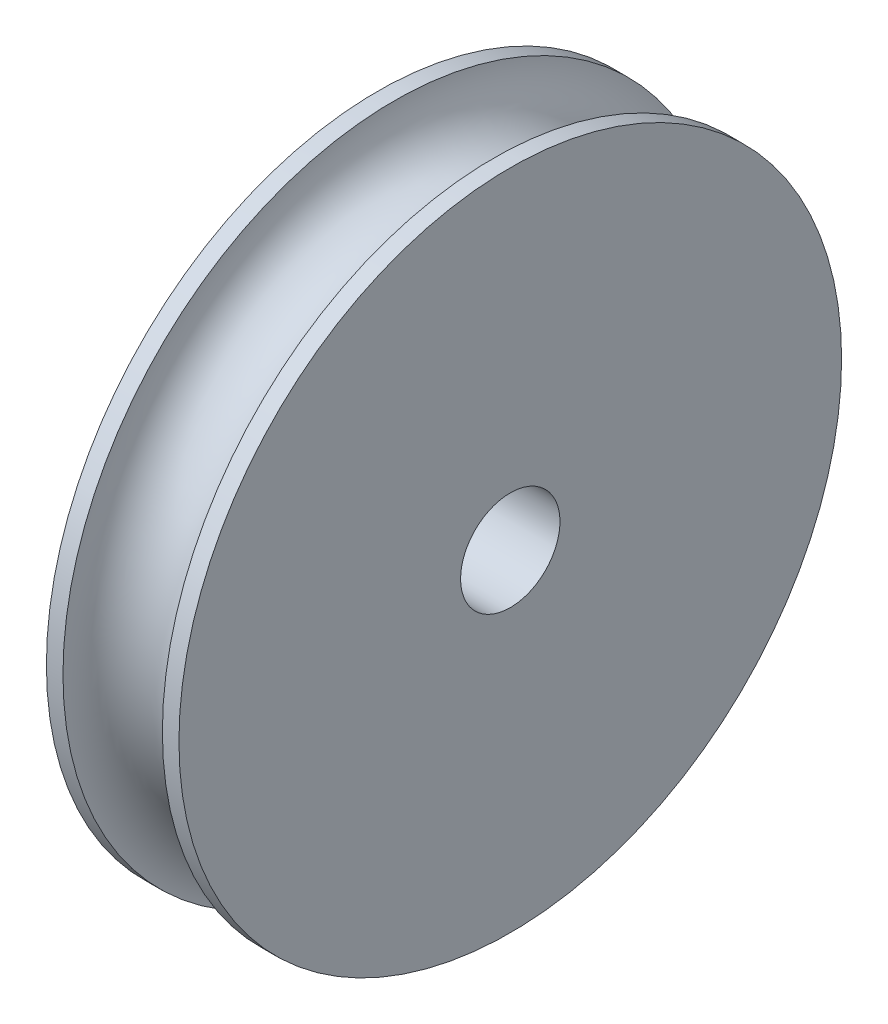
ISO-10303-21;
HEADER;
FILE_DESCRIPTION(('STEP AP214'),'2;1');
FILE_NAME('part.step','',(''),(''),'','','');
FILE_SCHEMA(('AUTOMOTIVE_DESIGN { 1 0 10303 214 1 1 1 1 }'));
ENDSEC;
DATA;
#1=APPLICATION_CONTEXT('core data for automotive mechanical design processes');
#2=APPLICATION_PROTOCOL_DEFINITION('international standard','automotive_design',2000,#1);
#3=PRODUCT_CONTEXT('',#1,'mechanical');
#4=PRODUCT('Part','Part','',(#3));
#5=PRODUCT_RELATED_PRODUCT_CATEGORY('part','',(#4));
#6=PRODUCT_DEFINITION_FORMATION('','',#4);
#7=PRODUCT_DEFINITION_CONTEXT('part definition',#1,'design');
#8=PRODUCT_DEFINITION('design','',#6,#7);
#9=PRODUCT_DEFINITION_SHAPE('','',#8);
#10=(LENGTH_UNIT() NAMED_UNIT(*) SI_UNIT(.MILLI.,.METRE.));
#11=(NAMED_UNIT(*) PLANE_ANGLE_UNIT() SI_UNIT($,.RADIAN.));
#12=(NAMED_UNIT(*) SI_UNIT($,.STERADIAN.) SOLID_ANGLE_UNIT());
#13=UNCERTAINTY_MEASURE_WITH_UNIT(LENGTH_MEASURE(1.E-05),#10,'distance_accuracy_value','');
#14=(GEOMETRIC_REPRESENTATION_CONTEXT(3) GLOBAL_UNCERTAINTY_ASSIGNED_CONTEXT((#13)) GLOBAL_UNIT_ASSIGNED_CONTEXT((#10,
#11,#12)) REPRESENTATION_CONTEXT('',''));
#15=CARTESIAN_POINT('',(0.,0.,0.));
#16=DIRECTION('',(0.,0.,1.));
#17=DIRECTION('',(1.,0.,0.));
#18=AXIS2_PLACEMENT_3D('',#15,#16,#17);
#19=CARTESIAN_POINT('',(363.144917120642,41.3157017452683,-226.556360518351));
#20=DIRECTION('',(-1.,0.,0.));
#21=DIRECTION('',(0.,0.,1.));
#22=AXIS2_PLACEMENT_3D('',#19,#20,#21);
#23=CYLINDRICAL_SURFACE('',#22,9.99999999999997);
#24=CARTESIAN_POINT('',(362.894917120642,41.3157017452683,-226.556360518351));
#25=DIRECTION('',(-1.,0.,0.));
#26=DIRECTION('',(0.,0.,1.));
#27=AXIS2_PLACEMENT_3D('',#24,#25,#26);
#28=CIRCLE('',#27,9.99999999999997);
#29=CARTESIAN_POINT('',(362.894917120642,41.3157017452683,-216.556360518351));
#30=VERTEX_POINT('',#29);
#31=EDGE_CURVE('E18',#30,#30,#28,.T.);
#32=ORIENTED_EDGE('',*,*,#31,.F.);
#33=EDGE_LOOP('',(#32));
#34=FACE_BOUND('',#33,.T.);
#35=CARTESIAN_POINT('',(363.394917120642,41.3157017452683,-226.556360518351));
#36=DIRECTION('',(1.,0.,0.));
#37=DIRECTION('',(0.,0.,-1.));
#38=AXIS2_PLACEMENT_3D('',#35,#36,#37);
#39=CIRCLE('',#38,10.);
#40=CARTESIAN_POINT('',(363.394917120642,41.3157017452683,-236.556360518351));
#41=VERTEX_POINT('',#40);
#42=EDGE_CURVE('E30',#41,#41,#39,.F.);
#43=ORIENTED_EDGE('',*,*,#42,.T.);
#44=EDGE_LOOP('',(#43));
#45=FACE_BOUND('',#44,.T.);
#46=ADVANCED_FACE('F15',(#34,#45),#23,.T.);
#47=CARTESIAN_POINT('',(364.894917120642,41.3157017452683,-226.556360518351));
#48=DIRECTION('',(1.,0.,0.));
#49=DIRECTION('',(0.,0.,-1.));
#50=AXIS2_PLACEMENT_3D('',#47,#48,#49);
#51=TOROIDAL_SURFACE('',#50,9.99999999999998,1.5);
#52=ORIENTED_EDGE('',*,*,#42,.F.);
#53=EDGE_LOOP('',(#52));
#54=FACE_BOUND('',#53,.T.);
#55=CARTESIAN_POINT('',(366.394917120642,41.3157017452683,-226.556360518351));
#56=DIRECTION('',(-1.,0.,0.));
#57=DIRECTION('',(0.,0.,1.));
#58=AXIS2_PLACEMENT_3D('',#55,#56,#57);
#59=CIRCLE('',#58,9.99999999999997);
#60=CARTESIAN_POINT('',(366.394917120642,41.3157017452683,-216.556360518351));
#61=VERTEX_POINT('',#60);
#62=EDGE_CURVE('E33',#61,#61,#59,.F.);
#63=ORIENTED_EDGE('',*,*,#62,.F.);
#64=EDGE_LOOP('',(#63));
#65=FACE_BOUND('',#64,.T.);
#66=ADVANCED_FACE('F42',(#54,#65),#51,.F.);
#67=CARTESIAN_POINT('',(362.894917120642,41.3157017452683,-232.306360518351));
#68=DIRECTION('',(-1.,0.,0.));
#69=DIRECTION('',(0.,0.,1.));
#70=AXIS2_PLACEMENT_3D('',#67,#68,#69);
#71=PLANE('',#70);
#72=ORIENTED_EDGE('',*,*,#31,.T.);
#73=EDGE_LOOP('',(#72));
#74=FACE_BOUND('',#73,.T.);
#75=CARTESIAN_POINT('',(362.894917120642,41.3157017452683,-226.556360518351));
#76=DIRECTION('',(-1.,0.,0.));
#77=DIRECTION('',(0.,0.,1.));
#78=AXIS2_PLACEMENT_3D('',#75,#76,#77);
#79=CIRCLE('',#78,1.49999999999997);
#80=CARTESIAN_POINT('',(362.894917120642,41.3157017452683,-225.056360518351));
#81=VERTEX_POINT('',#80);
#82=EDGE_CURVE('E27',#81,#81,#79,.F.);
#83=ORIENTED_EDGE('',*,*,#82,.T.);
#84=EDGE_LOOP('',(#83));
#85=FACE_BOUND('',#84,.T.);
#86=ADVANCED_FACE('F45',(#74,#85),#71,.T.);
#87=CARTESIAN_POINT('',(366.644917120642,41.3157017452683,-226.556360518351));
#88=DIRECTION('',(-1.,0.,0.));
#89=DIRECTION('',(0.,0.,1.));
#90=AXIS2_PLACEMENT_3D('',#87,#88,#89);
#91=CYLINDRICAL_SURFACE('',#90,9.99999999999997);
#92=ORIENTED_EDGE('',*,*,#62,.T.);
#93=EDGE_LOOP('',(#92));
#94=FACE_BOUND('',#93,.T.);
#95=CARTESIAN_POINT('',(366.894917120642,41.3157017452683,-226.556360518351));
#96=DIRECTION('',(-1.,0.,0.));
#97=DIRECTION('',(0.,0.,1.));
#98=AXIS2_PLACEMENT_3D('',#95,#96,#97);
#99=CIRCLE('',#98,9.99999999999997);
#100=CARTESIAN_POINT('',(366.894917120642,41.3157017452683,-216.556360518351));
#101=VERTEX_POINT('',#100);
#102=EDGE_CURVE('E22',#101,#101,#99,.F.);
#103=ORIENTED_EDGE('',*,*,#102,.F.);
#104=EDGE_LOOP('',(#103));
#105=FACE_BOUND('',#104,.T.);
#106=ADVANCED_FACE('F49',(#94,#105),#91,.T.);
#107=CARTESIAN_POINT('',(364.894917120642,41.3157017452683,-226.556360518351));
#108=DIRECTION('',(-1.,0.,0.));
#109=DIRECTION('',(0.,0.,1.));
#110=AXIS2_PLACEMENT_3D('',#107,#108,#109);
#111=CYLINDRICAL_SURFACE('',#110,1.49999999999997);
#112=CARTESIAN_POINT('',(366.894917120642,41.3157017452683,-226.556360518351));
#113=DIRECTION('',(-1.,0.,0.));
#114=DIRECTION('',(0.,0.,1.));
#115=AXIS2_PLACEMENT_3D('',#112,#113,#114);
#116=CIRCLE('',#115,1.49999999999997);
#117=CARTESIAN_POINT('',(366.894917120642,41.3157017452683,-225.056360518351));
#118=VERTEX_POINT('',#117);
#119=EDGE_CURVE('E10',#118,#118,#116,.T.);
#120=ORIENTED_EDGE('',*,*,#119,.F.);
#121=EDGE_LOOP('',(#120));
#122=FACE_BOUND('',#121,.T.);
#123=ORIENTED_EDGE('',*,*,#82,.F.);
#124=EDGE_LOOP('',(#123));
#125=FACE_BOUND('',#124,.T.);
#126=ADVANCED_FACE('F53',(#122,#125),#111,.F.);
#127=CARTESIAN_POINT('',(366.894917120642,41.3157017452683,-232.306360518351));
#128=DIRECTION('',(1.,0.,0.));
#129=DIRECTION('',(0.,0.,-1.));
#130=AXIS2_PLACEMENT_3D('',#127,#128,#129);
#131=PLANE('',#130);
#132=ORIENTED_EDGE('',*,*,#119,.T.);
#133=EDGE_LOOP('',(#132));
#134=FACE_BOUND('',#133,.T.);
#135=ORIENTED_EDGE('',*,*,#102,.T.);
#136=EDGE_LOOP('',(#135));
#137=FACE_BOUND('',#136,.T.);
#138=ADVANCED_FACE('F56',(#134,#137),#131,.T.);
#139=CLOSED_SHELL('',(#46,#66,#86,#106,#126,#138));
#140=MANIFOLD_SOLID_BREP('B1',#139);
#141=ADVANCED_BREP_SHAPE_REPRESENTATION('',(#18,#140),#14);
#142=SHAPE_DEFINITION_REPRESENTATION(#9,#141);
ENDSEC;
END-ISO-10303-21;
